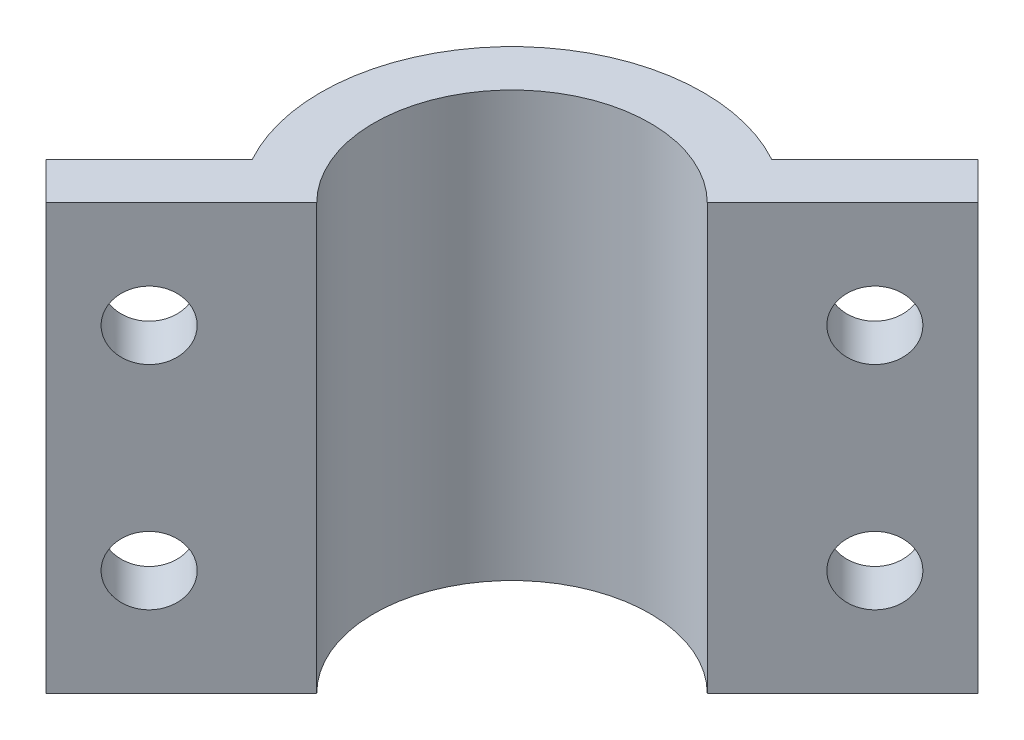
ISO-10303-21;
HEADER;
FILE_DESCRIPTION(('STEP AP214'),'2;1');
FILE_NAME('part.step','',(''),(''),'','','');
FILE_SCHEMA(('AUTOMOTIVE_DESIGN { 1 0 10303 214 1 1 1 1 }'));
ENDSEC;
DATA;
#1=APPLICATION_CONTEXT('core data for automotive mechanical design processes');
#2=APPLICATION_PROTOCOL_DEFINITION('international standard','automotive_design',2000,#1);
#3=PRODUCT_CONTEXT('',#1,'mechanical');
#4=PRODUCT('Part','Part','',(#3));
#5=PRODUCT_RELATED_PRODUCT_CATEGORY('part','',(#4));
#6=PRODUCT_DEFINITION_FORMATION('','',#4);
#7=PRODUCT_DEFINITION_CONTEXT('part definition',#1,'design');
#8=PRODUCT_DEFINITION('design','',#6,#7);
#9=PRODUCT_DEFINITION_SHAPE('','',#8);
#10=(LENGTH_UNIT() NAMED_UNIT(*) SI_UNIT(.MILLI.,.METRE.));
#11=(NAMED_UNIT(*) PLANE_ANGLE_UNIT() SI_UNIT($,.RADIAN.));
#12=(NAMED_UNIT(*) SI_UNIT($,.STERADIAN.) SOLID_ANGLE_UNIT());
#13=UNCERTAINTY_MEASURE_WITH_UNIT(LENGTH_MEASURE(1.E-05),#10,'distance_accuracy_value','');
#14=(GEOMETRIC_REPRESENTATION_CONTEXT(3) GLOBAL_UNCERTAINTY_ASSIGNED_CONTEXT((#13)) GLOBAL_UNIT_ASSIGNED_CONTEXT((#10,
#11,#12)) REPRESENTATION_CONTEXT('',''));
#15=CARTESIAN_POINT('',(0.,0.,0.));
#16=DIRECTION('',(0.,0.,1.));
#17=DIRECTION('',(1.,0.,0.));
#18=AXIS2_PLACEMENT_3D('',#15,#16,#17);
#19=CARTESIAN_POINT('',(0.,-1.5,0.));
#20=DIRECTION('',(0.,-1.,0.));
#21=DIRECTION('',(0.,0.,-1.));
#22=AXIS2_PLACEMENT_3D('',#19,#20,#21);
#23=PLANE('',#22);
#24=DIRECTION('',(0.707106781186548,0.,-0.707106781186547));
#25=VECTOR('',#24,1.);
#26=CARTESIAN_POINT('',(-21.9375695991954,-1.5,21.9375695991954));
#27=LINE('',#26,#25);
#28=CARTESIAN_POINT('',(9.19238815542512,-1.5,-9.19238815542512));
#29=VERTEX_POINT('',#28);
#30=CARTESIAN_POINT('',(21.9375695991955,-1.5,-21.9375695991955));
#31=VERTEX_POINT('',#30);
#32=EDGE_CURVE('E171',#29,#31,#27,.T.);
#33=ORIENTED_EDGE('',*,*,#32,.T.);
#34=DIRECTION('',(0.707106781186547,0.,0.707106781186547));
#35=VECTOR('',#34,1.);
#36=CARTESIAN_POINT('',(18.4020356932627,-1.5,-25.4731035051282));
#37=LINE('',#36,#35);
#38=CARTESIAN_POINT('',(18.4020356932627,-1.50000000000001,-25.4731035051282));
#39=VERTEX_POINT('',#38);
#40=EDGE_CURVE('E152',#39,#31,#37,.T.);
#41=ORIENTED_EDGE('',*,*,#40,.F.);
#42=DIRECTION('',(0.707106781186547,0.,-0.707106781186548));
#43=VECTOR('',#42,1.);
#44=CARTESIAN_POINT('',(8.69148535470475,-1.5,-15.7625531665702));
#45=LINE('',#44,#43);
#46=CARTESIAN_POINT('',(8.69148535470475,-1.5,-15.7625531665702));
#47=VERTEX_POINT('',#46);
#48=EDGE_CURVE('E155',#47,#39,#45,.T.);
#49=ORIENTED_EDGE('',*,*,#48,.F.);
#50=CARTESIAN_POINT('',(0.,-1.5,0.));
#51=DIRECTION('',(0.,-1.,0.));
#52=DIRECTION('',(0.,0.,-1.));
#53=AXIS2_PLACEMENT_3D('',#50,#51,#52);
#54=CIRCLE('',#53,18.);
#55=CARTESIAN_POINT('',(-15.7625531665702,-1.50000000000001,8.69148535470475));
#56=VERTEX_POINT('',#55);
#57=EDGE_CURVE('E138',#56,#47,#54,.T.);
#58=ORIENTED_EDGE('',*,*,#57,.F.);
#59=DIRECTION('',(-0.707106781186548,0.,0.707106781186547));
#60=VECTOR('',#59,1.);
#61=CARTESIAN_POINT('',(-15.7625531665702,-1.5,8.69148535470475));
#62=LINE('',#61,#60);
#63=CARTESIAN_POINT('',(-25.4731035051282,-1.5,18.4020356932627));
#64=VERTEX_POINT('',#63);
#65=EDGE_CURVE('E132',#56,#64,#62,.T.);
#66=ORIENTED_EDGE('',*,*,#65,.T.);
#67=DIRECTION('',(0.707106781186547,0.,0.707106781186547));
#68=VECTOR('',#67,1.);
#69=CARTESIAN_POINT('',(-25.4731035051282,-1.5,18.4020356932627));
#70=LINE('',#69,#68);
#71=CARTESIAN_POINT('',(-21.9375695991954,-1.5,21.9375695991954));
#72=VERTEX_POINT('',#71);
#73=EDGE_CURVE('E136',#64,#72,#70,.T.);
#74=ORIENTED_EDGE('',*,*,#73,.T.);
#75=CARTESIAN_POINT('',(-9.19238815542512,-1.5,9.19238815542511));
#76=VERTEX_POINT('',#75);
#77=EDGE_CURVE('E177',#72,#76,#27,.T.);
#78=ORIENTED_EDGE('',*,*,#77,.T.);
#79=CARTESIAN_POINT('',(0.,-1.5,0.));
#80=DIRECTION('',(0.,-1.,0.));
#81=DIRECTION('',(0.,0.,-1.));
#82=AXIS2_PLACEMENT_3D('',#79,#80,#81);
#83=CIRCLE('',#82,13.);
#84=EDGE_CURVE('E174',#76,#29,#83,.T.);
#85=ORIENTED_EDGE('',*,*,#84,.T.);
#86=EDGE_LOOP('',(#33,#41,#49,#58,#66,#74,#78,#85));
#87=FACE_BOUND('',#86,.T.);
#88=ADVANCED_FACE('F65',(#87),#23,.F.);
#89=CARTESIAN_POINT('',(0.,-41.5,0.));
#90=DIRECTION('',(0.,-1.,0.));
#91=DIRECTION('',(0.,0.,-1.));
#92=AXIS2_PLACEMENT_3D('',#89,#90,#91);
#93=PLANE('',#92);
#94=DIRECTION('',(0.707106781186547,0.,0.707106781186547));
#95=VECTOR('',#94,1.);
#96=CARTESIAN_POINT('',(18.4020356932627,-41.5,-25.4731035051282));
#97=LINE('',#96,#95);
#98=CARTESIAN_POINT('',(18.4020356932627,-41.5,-25.4731035051282));
#99=VERTEX_POINT('',#98);
#100=CARTESIAN_POINT('',(21.9375695991955,-41.5,-21.9375695991955));
#101=VERTEX_POINT('',#100);
#102=EDGE_CURVE('E168',#99,#101,#97,.T.);
#103=ORIENTED_EDGE('',*,*,#102,.T.);
#104=DIRECTION('',(-0.707106781186548,0.,0.707106781186547));
#105=VECTOR('',#104,1.);
#106=CARTESIAN_POINT('',(-21.9375695991954,-41.5,21.9375695991954));
#107=LINE('',#106,#105);
#108=CARTESIAN_POINT('',(9.19238815542511,-41.5,-9.19238815542511));
#109=VERTEX_POINT('',#108);
#110=EDGE_CURVE('E182',#101,#109,#107,.T.);
#111=ORIENTED_EDGE('',*,*,#110,.T.);
#112=CARTESIAN_POINT('',(0.,-41.5,0.));
#113=DIRECTION('',(0.,-1.,0.));
#114=DIRECTION('',(0.,0.,-1.));
#115=AXIS2_PLACEMENT_3D('',#112,#113,#114);
#116=CIRCLE('',#115,13.);
#117=CARTESIAN_POINT('',(-9.19238815542512,-41.5,9.19238815542511));
#118=VERTEX_POINT('',#117);
#119=EDGE_CURVE('E212',#118,#109,#116,.T.);
#120=ORIENTED_EDGE('',*,*,#119,.F.);
#121=CARTESIAN_POINT('',(-21.9375695991954,-41.5,21.9375695991954));
#122=VERTEX_POINT('',#121);
#123=EDGE_CURVE('E81',#118,#122,#107,.T.);
#124=ORIENTED_EDGE('',*,*,#123,.T.);
#125=DIRECTION('',(0.707106781186547,0.,0.707106781186547));
#126=VECTOR('',#125,1.);
#127=CARTESIAN_POINT('',(-25.4731035051282,-41.5,18.4020356932627));
#128=LINE('',#127,#126);
#129=CARTESIAN_POINT('',(-25.4731035051282,-41.5,18.4020356932627));
#130=VERTEX_POINT('',#129);
#131=EDGE_CURVE('E221',#130,#122,#128,.T.);
#132=ORIENTED_EDGE('',*,*,#131,.F.);
#133=DIRECTION('',(-0.707106781186548,0.,0.707106781186547));
#134=VECTOR('',#133,1.);
#135=CARTESIAN_POINT('',(-15.7625531665702,-41.5,8.69148535470475));
#136=LINE('',#135,#134);
#137=CARTESIAN_POINT('',(-15.7625531665702,-41.5,8.69148535470475));
#138=VERTEX_POINT('',#137);
#139=EDGE_CURVE('E144',#138,#130,#136,.T.);
#140=ORIENTED_EDGE('',*,*,#139,.F.);
#141=CARTESIAN_POINT('',(0.,-41.5,0.));
#142=DIRECTION('',(0.,-1.,0.));
#143=DIRECTION('',(0.,0.,-1.));
#144=AXIS2_PLACEMENT_3D('',#141,#142,#143);
#145=CIRCLE('',#144,18.);
#146=CARTESIAN_POINT('',(8.69148535470475,-41.5,-15.7625531665702));
#147=VERTEX_POINT('',#146);
#148=EDGE_CURVE('E139',#138,#147,#145,.T.);
#149=ORIENTED_EDGE('',*,*,#148,.T.);
#150=DIRECTION('',(0.707106781186547,0.,-0.707106781186548));
#151=VECTOR('',#150,1.);
#152=CARTESIAN_POINT('',(8.69148535470475,-41.5,-15.7625531665702));
#153=LINE('',#152,#151);
#154=EDGE_CURVE('E218',#147,#99,#153,.T.);
#155=ORIENTED_EDGE('',*,*,#154,.T.);
#156=EDGE_LOOP('',(#103,#111,#120,#124,#132,#140,#149,#155));
#157=FACE_BOUND('',#156,.T.);
#158=ADVANCED_FACE('F228',(#157),#93,.T.);
#159=CARTESIAN_POINT('',(18.4020356932627,-41.5,-25.4731035051282));
#160=DIRECTION('',(-0.707106781186548,0.,0.707106781186548));
#161=DIRECTION('',(0.707106781186548,0.,0.707106781186548));
#162=AXIS2_PLACEMENT_3D('',#159,#160,#161);
#163=PLANE('',#162);
#164=DIRECTION('',(0.,-1.,0.));
#165=VECTOR('',#164,1.);
#166=CARTESIAN_POINT('',(21.9375695991955,255.604025639429,-21.9375695991955));
#167=LINE('',#166,#165);
#168=EDGE_CURVE('E179',#31,#101,#167,.T.);
#169=ORIENTED_EDGE('',*,*,#168,.T.);
#170=ORIENTED_EDGE('',*,*,#102,.F.);
#171=DIRECTION('',(0.,1.,0.));
#172=VECTOR('',#171,1.);
#173=CARTESIAN_POINT('',(18.4020356932627,-41.5,-25.4731035051282));
#174=LINE('',#173,#172);
#175=EDGE_CURVE('E74',#99,#39,#174,.T.);
#176=ORIENTED_EDGE('',*,*,#175,.T.);
#177=ORIENTED_EDGE('',*,*,#40,.T.);
#178=EDGE_LOOP('',(#169,#170,#176,#177));
#179=FACE_BOUND('',#178,.T.);
#180=ADVANCED_FACE('F166',(#179),#163,.F.);
#181=CARTESIAN_POINT('',(-25.4731035051282,-41.5,18.4020356932627));
#182=DIRECTION('',(-0.707106781186548,0.,0.707106781186548));
#183=DIRECTION('',(0.707106781186548,0.,0.707106781186548));
#184=AXIS2_PLACEMENT_3D('',#181,#182,#183);
#185=PLANE('',#184);
#186=ORIENTED_EDGE('',*,*,#131,.T.);
#187=DIRECTION('',(0.,-1.,0.));
#188=VECTOR('',#187,1.);
#189=CARTESIAN_POINT('',(-21.9375695991954,255.604025639429,21.9375695991954));
#190=LINE('',#189,#188);
#191=EDGE_CURVE('E151',#72,#122,#190,.T.);
#192=ORIENTED_EDGE('',*,*,#191,.F.);
#193=ORIENTED_EDGE('',*,*,#73,.F.);
#194=DIRECTION('',(0.,1.,0.));
#195=VECTOR('',#194,1.);
#196=CARTESIAN_POINT('',(-25.4731035051282,-41.5,18.4020356932627));
#197=LINE('',#196,#195);
#198=EDGE_CURVE('E141',#130,#64,#197,.T.);
#199=ORIENTED_EDGE('',*,*,#198,.F.);
#200=EDGE_LOOP('',(#186,#192,#193,#199));
#201=FACE_BOUND('',#200,.T.);
#202=ADVANCED_FACE('F150',(#201),#185,.T.);
#203=CARTESIAN_POINT('',(0.,-41.5,0.));
#204=DIRECTION('',(0.,1.,0.));
#205=DIRECTION('',(0.,0.,1.));
#206=AXIS2_PLACEMENT_3D('',#203,#204,#205);
#207=CYLINDRICAL_SURFACE('',#206,13.);
#208=ORIENTED_EDGE('',*,*,#119,.T.);
#209=DIRECTION('',(0.,1.,0.));
#210=VECTOR('',#209,1.);
#211=CARTESIAN_POINT('',(9.19238815542512,-41.5,-9.19238815542512));
#212=LINE('',#211,#210);
#213=EDGE_CURVE('E198',#109,#29,#212,.T.);
#214=ORIENTED_EDGE('',*,*,#213,.T.);
#215=ORIENTED_EDGE('',*,*,#84,.F.);
#216=DIRECTION('',(0.,1.,0.));
#217=VECTOR('',#216,1.);
#218=CARTESIAN_POINT('',(-9.19238815542512,-41.5,9.19238815542511));
#219=LINE('',#218,#217);
#220=EDGE_CURVE('E196',#76,#118,#219,.F.);
#221=ORIENTED_EDGE('',*,*,#220,.T.);
#222=EDGE_LOOP('',(#208,#214,#215,#221));
#223=FACE_BOUND('',#222,.T.);
#224=ADVANCED_FACE('F231',(#223),#207,.F.);
#225=CARTESIAN_POINT('',(20.6178283358492,-31.5,-13.5467605239837));
#226=DIRECTION('',(0.707106781186547,0.,0.707106781186548));
#227=DIRECTION('',(0.707106781186548,0.,-0.707106781186547));
#228=AXIS2_PLACEMENT_3D('',#225,#226,#227);
#229=CYLINDRICAL_SURFACE('',#228,3.19999999999999);
#230=CARTESIAN_POINT('',(13.5467605239837,-31.5,-20.6178283358492));
#231=DIRECTION('',(0.707106781186548,0.,0.707106781186547));
#232=DIRECTION('',(0.707106781186547,0.,-0.707106781186548));
#233=AXIS2_PLACEMENT_3D('',#230,#231,#232);
#234=CIRCLE('',#233,3.19999999999999);
#235=CARTESIAN_POINT('',(15.8095022237807,-31.5,-22.8805700356462));
#236=VERTEX_POINT('',#235);
#237=EDGE_CURVE('E209',#236,#236,#234,.T.);
#238=ORIENTED_EDGE('',*,*,#237,.F.);
#239=EDGE_LOOP('',(#238));
#240=FACE_BOUND('',#239,.T.);
#241=CARTESIAN_POINT('',(17.0822944299165,-31.5,-17.0822944299165));
#242=DIRECTION('',(0.707106781186547,0.,0.707106781186548));
#243=DIRECTION('',(0.707106781186548,0.,-0.707106781186547));
#244=AXIS2_PLACEMENT_3D('',#241,#242,#243);
#245=CIRCLE('',#244,3.19999999999999);
#246=CARTESIAN_POINT('',(19.3450361297134,-31.5,-19.3450361297134));
#247=VERTEX_POINT('',#246);
#248=EDGE_CURVE('E193',#247,#247,#245,.F.);
#249=ORIENTED_EDGE('',*,*,#248,.F.);
#250=EDGE_LOOP('',(#249));
#251=FACE_BOUND('',#250,.T.);
#252=ADVANCED_FACE('F273',(#240,#251),#229,.F.);
#253=CARTESIAN_POINT('',(20.6178283358492,-11.5,-13.5467605239837));
#254=DIRECTION('',(0.707106781186547,0.,0.707106781186548));
#255=DIRECTION('',(0.707106781186548,0.,-0.707106781186547));
#256=AXIS2_PLACEMENT_3D('',#253,#254,#255);
#257=CYLINDRICAL_SURFACE('',#256,3.19999999999999);
#258=CARTESIAN_POINT('',(13.5467605239837,-11.5,-20.6178283358492));
#259=DIRECTION('',(0.707106781186548,0.,0.707106781186547));
#260=DIRECTION('',(0.707106781186547,0.,-0.707106781186548));
#261=AXIS2_PLACEMENT_3D('',#258,#259,#260);
#262=CIRCLE('',#261,3.19999999999999);
#263=CARTESIAN_POINT('',(15.8095022237807,-11.5,-22.8805700356462));
#264=VERTEX_POINT('',#263);
#265=EDGE_CURVE('E206',#264,#264,#262,.T.);
#266=ORIENTED_EDGE('',*,*,#265,.F.);
#267=EDGE_LOOP('',(#266));
#268=FACE_BOUND('',#267,.T.);
#269=CARTESIAN_POINT('',(17.0822944299165,-11.5,-17.0822944299165));
#270=DIRECTION('',(0.707106781186547,0.,0.707106781186548));
#271=DIRECTION('',(0.707106781186548,0.,-0.707106781186547));
#272=AXIS2_PLACEMENT_3D('',#269,#270,#271);
#273=CIRCLE('',#272,3.19999999999999);
#274=CARTESIAN_POINT('',(19.3450361297134,-11.5,-19.3450361297134));
#275=VERTEX_POINT('',#274);
#276=EDGE_CURVE('E190',#275,#275,#273,.F.);
#277=ORIENTED_EDGE('',*,*,#276,.F.);
#278=EDGE_LOOP('',(#277));
#279=FACE_BOUND('',#278,.T.);
#280=ADVANCED_FACE('F247',(#268,#279),#257,.F.);
#281=CARTESIAN_POINT('',(-13.5467605239837,-31.5,20.6178283358492));
#282=DIRECTION('',(0.707106781186547,0.,0.707106781186548));
#283=DIRECTION('',(0.707106781186548,0.,-0.707106781186547));
#284=AXIS2_PLACEMENT_3D('',#281,#282,#283);
#285=CYLINDRICAL_SURFACE('',#284,3.19999999999999);
#286=CARTESIAN_POINT('',(-20.6178283358492,-31.5,13.5467605239837));
#287=DIRECTION('',(-0.707106781186547,0.,-0.707106781186548));
#288=DIRECTION('',(-0.707106781186548,0.,0.707106781186547));
#289=AXIS2_PLACEMENT_3D('',#286,#287,#288);
#290=CIRCLE('',#289,3.19999999999999);
#291=CARTESIAN_POINT('',(-22.8805700356461,-31.5,15.8095022237807));
#292=VERTEX_POINT('',#291);
#293=EDGE_CURVE('E203',#292,#292,#290,.T.);
#294=ORIENTED_EDGE('',*,*,#293,.T.);
#295=EDGE_LOOP('',(#294));
#296=FACE_BOUND('',#295,.T.);
#297=CARTESIAN_POINT('',(-17.0822944299165,-31.5,17.0822944299164));
#298=DIRECTION('',(0.707106781186547,0.,0.707106781186548));
#299=DIRECTION('',(0.707106781186548,0.,-0.707106781186547));
#300=AXIS2_PLACEMENT_3D('',#297,#298,#299);
#301=CIRCLE('',#300,3.19999999999999);
#302=CARTESIAN_POINT('',(-14.8195527301195,-31.5,14.8195527301195));
#303=VERTEX_POINT('',#302);
#304=EDGE_CURVE('E187',#303,#303,#301,.F.);
#305=ORIENTED_EDGE('',*,*,#304,.F.);
#306=EDGE_LOOP('',(#305));
#307=FACE_BOUND('',#306,.T.);
#308=ADVANCED_FACE('F240',(#296,#307),#285,.F.);
#309=CARTESIAN_POINT('',(-13.5467605239837,-11.5,20.6178283358492));
#310=DIRECTION('',(0.707106781186547,0.,0.707106781186548));
#311=DIRECTION('',(0.707106781186548,0.,-0.707106781186547));
#312=AXIS2_PLACEMENT_3D('',#309,#310,#311);
#313=CYLINDRICAL_SURFACE('',#312,3.19999999999999);
#314=CARTESIAN_POINT('',(-20.6178283358492,-11.5,13.5467605239837));
#315=DIRECTION('',(-0.707106781186547,0.,-0.707106781186548));
#316=DIRECTION('',(-0.707106781186548,0.,0.707106781186547));
#317=AXIS2_PLACEMENT_3D('',#314,#315,#316);
#318=CIRCLE('',#317,3.19999999999999);
#319=CARTESIAN_POINT('',(-22.8805700356461,-11.5,15.8095022237807));
#320=VERTEX_POINT('',#319);
#321=EDGE_CURVE('E200',#320,#320,#318,.T.);
#322=ORIENTED_EDGE('',*,*,#321,.T.);
#323=EDGE_LOOP('',(#322));
#324=FACE_BOUND('',#323,.T.);
#325=CARTESIAN_POINT('',(-17.0822944299165,-11.5,17.0822944299164));
#326=DIRECTION('',(0.707106781186547,0.,0.707106781186548));
#327=DIRECTION('',(0.707106781186548,0.,-0.707106781186547));
#328=AXIS2_PLACEMENT_3D('',#325,#326,#327);
#329=CIRCLE('',#328,3.19999999999999);
#330=CARTESIAN_POINT('',(-14.8195527301195,-11.5,14.8195527301195));
#331=VERTEX_POINT('',#330);
#332=EDGE_CURVE('E69',#331,#331,#329,.F.);
#333=ORIENTED_EDGE('',*,*,#332,.F.);
#334=EDGE_LOOP('',(#333));
#335=FACE_BOUND('',#334,.T.);
#336=ADVANCED_FACE('F238',(#324,#335),#313,.F.);
#337=CARTESIAN_POINT('',(0.,-41.5,0.));
#338=DIRECTION('',(0.,1.,0.));
#339=DIRECTION('',(0.,0.,1.));
#340=AXIS2_PLACEMENT_3D('',#337,#338,#339);
#341=CYLINDRICAL_SURFACE('',#340,18.);
#342=ORIENTED_EDGE('',*,*,#57,.T.);
#343=DIRECTION('',(0.,1.,0.));
#344=VECTOR('',#343,1.);
#345=CARTESIAN_POINT('',(8.69148535470475,-41.5,-15.7625531665702));
#346=LINE('',#345,#344);
#347=EDGE_CURVE('E13',#147,#47,#346,.T.);
#348=ORIENTED_EDGE('',*,*,#347,.F.);
#349=ORIENTED_EDGE('',*,*,#148,.F.);
#350=DIRECTION('',(0.,1.,0.));
#351=VECTOR('',#350,1.);
#352=CARTESIAN_POINT('',(-15.7625531665702,-41.5,8.69148535470475));
#353=LINE('',#352,#351);
#354=EDGE_CURVE('E89',#138,#56,#353,.T.);
#355=ORIENTED_EDGE('',*,*,#354,.T.);
#356=EDGE_LOOP('',(#342,#348,#349,#355));
#357=FACE_BOUND('',#356,.T.);
#358=ADVANCED_FACE('F67',(#357),#341,.T.);
#359=CARTESIAN_POINT('',(8.69148535470475,-41.5,-15.7625531665702));
#360=DIRECTION('',(0.707106781186548,0.,0.707106781186547));
#361=DIRECTION('',(0.707106781186547,0.,-0.707106781186548));
#362=AXIS2_PLACEMENT_3D('',#359,#360,#361);
#363=PLANE('',#362);
#364=ORIENTED_EDGE('',*,*,#265,.T.);
#365=EDGE_LOOP('',(#364));
#366=FACE_BOUND('',#365,.T.);
#367=ORIENTED_EDGE('',*,*,#237,.T.);
#368=EDGE_LOOP('',(#367));
#369=FACE_BOUND('',#368,.T.);
#370=ORIENTED_EDGE('',*,*,#48,.T.);
#371=ORIENTED_EDGE('',*,*,#175,.F.);
#372=ORIENTED_EDGE('',*,*,#154,.F.);
#373=ORIENTED_EDGE('',*,*,#347,.T.);
#374=EDGE_LOOP('',(#370,#371,#372,#373));
#375=FACE_BOUND('',#374,.T.);
#376=ADVANCED_FACE('F224',(#366,#369,#375),#363,.F.);
#377=CARTESIAN_POINT('',(-15.7625531665702,-41.5,8.69148535470475));
#378=DIRECTION('',(-0.707106781186547,0.,-0.707106781186548));
#379=DIRECTION('',(-0.707106781186548,0.,0.707106781186547));
#380=AXIS2_PLACEMENT_3D('',#377,#378,#379);
#381=PLANE('',#380);
#382=ORIENTED_EDGE('',*,*,#321,.F.);
#383=EDGE_LOOP('',(#382));
#384=FACE_BOUND('',#383,.T.);
#385=ORIENTED_EDGE('',*,*,#293,.F.);
#386=EDGE_LOOP('',(#385));
#387=FACE_BOUND('',#386,.T.);
#388=ORIENTED_EDGE('',*,*,#65,.F.);
#389=ORIENTED_EDGE('',*,*,#354,.F.);
#390=ORIENTED_EDGE('',*,*,#139,.T.);
#391=ORIENTED_EDGE('',*,*,#198,.T.);
#392=EDGE_LOOP('',(#388,#389,#390,#391));
#393=FACE_BOUND('',#392,.T.);
#394=ADVANCED_FACE('F142',(#384,#387,#393),#381,.T.);
#395=CARTESIAN_POINT('',(-21.9375695991954,255.604025639429,21.9375695991954));
#396=DIRECTION('',(0.707106781186547,0.,0.707106781186548));
#397=DIRECTION('',(0.707106781186548,0.,-0.707106781186547));
#398=AXIS2_PLACEMENT_3D('',#395,#396,#397);
#399=PLANE('',#398);
#400=ORIENTED_EDGE('',*,*,#248,.T.);
#401=EDGE_LOOP('',(#400));
#402=FACE_BOUND('',#401,.T.);
#403=ORIENTED_EDGE('',*,*,#276,.T.);
#404=EDGE_LOOP('',(#403));
#405=FACE_BOUND('',#404,.T.);
#406=ORIENTED_EDGE('',*,*,#110,.F.);
#407=ORIENTED_EDGE('',*,*,#168,.F.);
#408=ORIENTED_EDGE('',*,*,#32,.F.);
#409=ORIENTED_EDGE('',*,*,#213,.F.);
#410=EDGE_LOOP('',(#406,#407,#408,#409));
#411=FACE_BOUND('',#410,.T.);
#412=ADVANCED_FACE('F180',(#402,#405,#411),#399,.T.);
#413=ORIENTED_EDGE('',*,*,#77,.F.);
#414=ORIENTED_EDGE('',*,*,#191,.T.);
#415=ORIENTED_EDGE('',*,*,#123,.F.);
#416=ORIENTED_EDGE('',*,*,#220,.F.);
#417=EDGE_LOOP('',(#413,#414,#415,#416));
#418=FACE_BOUND('',#417,.T.);
#419=ORIENTED_EDGE('',*,*,#332,.T.);
#420=EDGE_LOOP('',(#419));
#421=FACE_BOUND('',#420,.T.);
#422=ORIENTED_EDGE('',*,*,#304,.T.);
#423=EDGE_LOOP('',(#422));
#424=FACE_BOUND('',#423,.T.);
#425=ADVANCED_FACE('F232',(#418,#421,#424),#399,.T.);
#426=CLOSED_SHELL('',(#88,#158,#180,#202,#224,#252,#280,#308,#336,#358,#376,#394,#412,#425));
#427=MANIFOLD_SOLID_BREP('B2',#426);
#428=ADVANCED_BREP_SHAPE_REPRESENTATION('',(#18,#427),#14);
#429=SHAPE_DEFINITION_REPRESENTATION(#9,#428);
ENDSEC;
END-ISO-10303-21;
